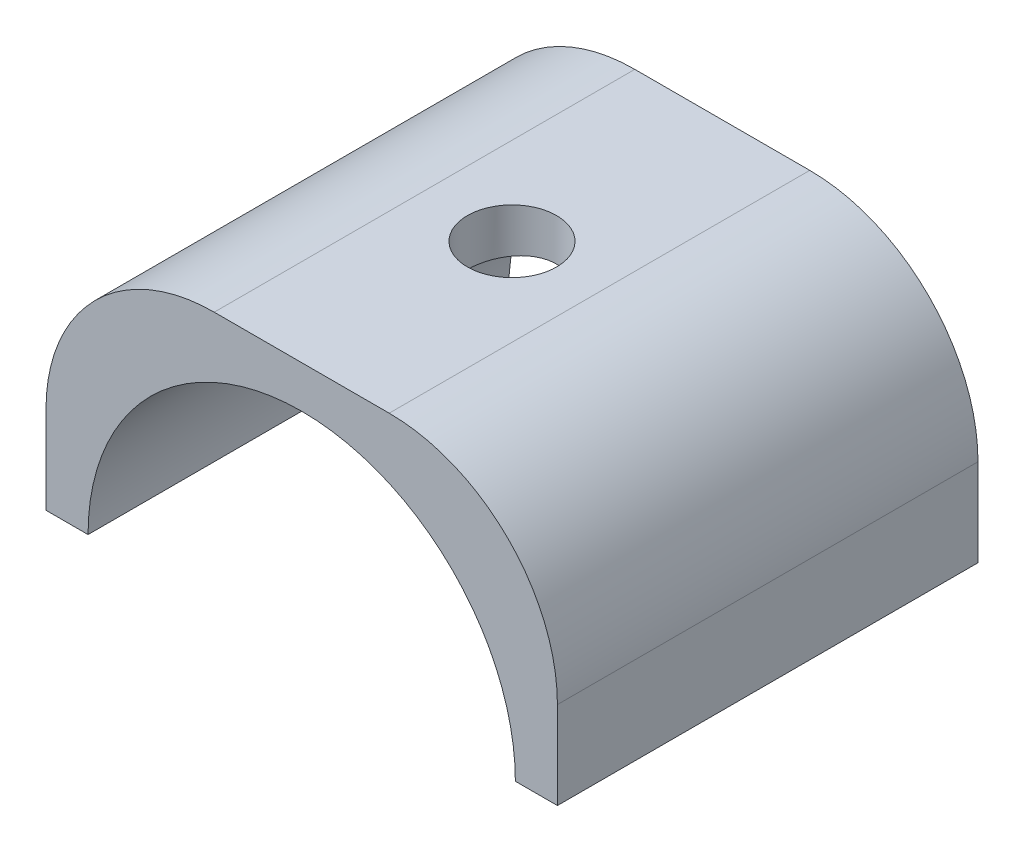
ISO-10303-21;
HEADER;
FILE_DESCRIPTION(('STEP AP214'),'2;1');
FILE_NAME('part.step','',(''),(''),'','','');
FILE_SCHEMA(('AUTOMOTIVE_DESIGN { 1 0 10303 214 1 1 1 1 }'));
ENDSEC;
DATA;
#1=APPLICATION_CONTEXT('core data for automotive mechanical design processes');
#2=APPLICATION_PROTOCOL_DEFINITION('international standard','automotive_design',2000,#1);
#3=PRODUCT_CONTEXT('',#1,'mechanical');
#4=PRODUCT('Part','Part','',(#3));
#5=PRODUCT_RELATED_PRODUCT_CATEGORY('part','',(#4));
#6=PRODUCT_DEFINITION_FORMATION('','',#4);
#7=PRODUCT_DEFINITION_CONTEXT('part definition',#1,'design');
#8=PRODUCT_DEFINITION('design','',#6,#7);
#9=PRODUCT_DEFINITION_SHAPE('','',#8);
#10=(LENGTH_UNIT() NAMED_UNIT(*) SI_UNIT(.MILLI.,.METRE.));
#11=(NAMED_UNIT(*) PLANE_ANGLE_UNIT() SI_UNIT($,.RADIAN.));
#12=(NAMED_UNIT(*) SI_UNIT($,.STERADIAN.) SOLID_ANGLE_UNIT());
#13=UNCERTAINTY_MEASURE_WITH_UNIT(LENGTH_MEASURE(1.E-05),#10,'distance_accuracy_value','');
#14=(GEOMETRIC_REPRESENTATION_CONTEXT(3) GLOBAL_UNCERTAINTY_ASSIGNED_CONTEXT((#13)) GLOBAL_UNIT_ASSIGNED_CONTEXT((#10,
#11,#12)) REPRESENTATION_CONTEXT('',''));
#15=CARTESIAN_POINT('',(0.,0.,0.));
#16=DIRECTION('',(0.,0.,1.));
#17=DIRECTION('',(1.,0.,0.));
#18=AXIS2_PLACEMENT_3D('',#15,#16,#17);
#19=CARTESIAN_POINT('',(5.2,5.2,12.5));
#20=DIRECTION('',(0.,0.,-1.));
#21=DIRECTION('',(-1.,0.,0.));
#22=AXIS2_PLACEMENT_3D('',#19,#20,#21);
#23=CYLINDRICAL_SURFACE('',#22,10.);
#24=CARTESIAN_POINT('',(5.2,5.2,-12.5));
#25=DIRECTION('',(0.,0.,1.));
#26=DIRECTION('',(1.,0.,0.));
#27=AXIS2_PLACEMENT_3D('',#24,#25,#26);
#28=CIRCLE('',#27,10.);
#29=CARTESIAN_POINT('',(15.2,5.2,-12.5));
#30=VERTEX_POINT('',#29);
#31=CARTESIAN_POINT('',(5.2,15.2,-12.5));
#32=VERTEX_POINT('',#31);
#33=EDGE_CURVE('E282',#30,#32,#28,.T.);
#34=ORIENTED_EDGE('',*,*,#33,.T.);
#35=DIRECTION('',(0.,0.,-1.));
#36=VECTOR('',#35,1.);
#37=CARTESIAN_POINT('',(5.2,15.2,12.5));
#38=LINE('',#37,#36);
#39=CARTESIAN_POINT('',(5.2,15.2,12.5));
#40=VERTEX_POINT('',#39);
#41=EDGE_CURVE('E11',#40,#32,#38,.T.);
#42=ORIENTED_EDGE('',*,*,#41,.F.);
#43=CARTESIAN_POINT('',(5.2,5.2,12.5));
#44=DIRECTION('',(0.,0.,1.));
#45=DIRECTION('',(1.,0.,0.));
#46=AXIS2_PLACEMENT_3D('',#43,#44,#45);
#47=CIRCLE('',#46,10.);
#48=CARTESIAN_POINT('',(15.2,5.2,12.5));
#49=VERTEX_POINT('',#48);
#50=EDGE_CURVE('E255',#49,#40,#47,.T.);
#51=ORIENTED_EDGE('',*,*,#50,.F.);
#52=DIRECTION('',(0.,0.,-1.));
#53=VECTOR('',#52,1.);
#54=CARTESIAN_POINT('',(15.2,5.2,12.5));
#55=LINE('',#54,#53);
#56=EDGE_CURVE('E281',#49,#30,#55,.T.);
#57=ORIENTED_EDGE('',*,*,#56,.T.);
#58=EDGE_LOOP('',(#34,#42,#51,#57));
#59=FACE_BOUND('',#58,.T.);
#60=ADVANCED_FACE('F39',(#59),#23,.T.);
#61=CARTESIAN_POINT('',(5.2,15.2,12.5));
#62=DIRECTION('',(0.,-1.,0.));
#63=DIRECTION('',(0.,0.,-1.));
#64=AXIS2_PLACEMENT_3D('',#61,#62,#63);
#65=PLANE('',#64);
#66=CARTESIAN_POINT('',(0.,15.2,0.));
#67=DIRECTION('',(0.,1.,0.));
#68=DIRECTION('',(0.,0.,1.));
#69=AXIS2_PLACEMENT_3D('',#66,#67,#68);
#70=CIRCLE('',#69,2.65);
#71=CARTESIAN_POINT('',(0.,15.2,2.65));
#72=VERTEX_POINT('',#71);
#73=EDGE_CURVE('E204',#72,#72,#70,.T.);
#74=ORIENTED_EDGE('',*,*,#73,.F.);
#75=EDGE_LOOP('',(#74));
#76=FACE_BOUND('',#75,.T.);
#77=DIRECTION('',(-1.,0.,0.));
#78=VECTOR('',#77,1.);
#79=CARTESIAN_POINT('',(5.2,15.2,-12.5));
#80=LINE('',#79,#78);
#81=CARTESIAN_POINT('',(-5.2,15.2,-12.5));
#82=VERTEX_POINT('',#81);
#83=EDGE_CURVE('E286',#32,#82,#80,.T.);
#84=ORIENTED_EDGE('',*,*,#83,.T.);
#85=DIRECTION('',(0.,0.,-1.));
#86=VECTOR('',#85,1.);
#87=CARTESIAN_POINT('',(-5.2,15.2,12.5));
#88=LINE('',#87,#86);
#89=CARTESIAN_POINT('',(-5.2,15.2,12.5));
#90=VERTEX_POINT('',#89);
#91=EDGE_CURVE('E53',#90,#82,#88,.T.);
#92=ORIENTED_EDGE('',*,*,#91,.F.);
#93=DIRECTION('',(-1.,0.,0.));
#94=VECTOR('',#93,1.);
#95=CARTESIAN_POINT('',(5.2,15.2,12.5));
#96=LINE('',#95,#94);
#97=EDGE_CURVE('E259',#40,#90,#96,.T.);
#98=ORIENTED_EDGE('',*,*,#97,.F.);
#99=ORIENTED_EDGE('',*,*,#41,.T.);
#100=EDGE_LOOP('',(#84,#92,#98,#99));
#101=FACE_BOUND('',#100,.T.);
#102=ADVANCED_FACE('F359',(#76,#101),#65,.F.);
#103=CARTESIAN_POINT('',(-5.2,5.2,12.5));
#104=DIRECTION('',(0.,0.,-1.));
#105=DIRECTION('',(-1.,0.,0.));
#106=AXIS2_PLACEMENT_3D('',#103,#104,#105);
#107=CYLINDRICAL_SURFACE('',#106,10.);
#108=CARTESIAN_POINT('',(-5.2,5.2,-12.5));
#109=DIRECTION('',(0.,0.,1.));
#110=DIRECTION('',(1.,0.,0.));
#111=AXIS2_PLACEMENT_3D('',#108,#109,#110);
#112=CIRCLE('',#111,10.);
#113=CARTESIAN_POINT('',(-15.2,5.2,-12.5));
#114=VERTEX_POINT('',#113);
#115=EDGE_CURVE('E289',#82,#114,#112,.T.);
#116=ORIENTED_EDGE('',*,*,#115,.T.);
#117=DIRECTION('',(0.,0.,-1.));
#118=VECTOR('',#117,1.);
#119=CARTESIAN_POINT('',(-15.2,5.2,12.5));
#120=LINE('',#119,#118);
#121=CARTESIAN_POINT('',(-15.2,5.2,12.5));
#122=VERTEX_POINT('',#121);
#123=EDGE_CURVE('E325',#122,#114,#120,.T.);
#124=ORIENTED_EDGE('',*,*,#123,.F.);
#125=CARTESIAN_POINT('',(-5.2,5.2,12.5));
#126=DIRECTION('',(0.,0.,1.));
#127=DIRECTION('',(1.,0.,0.));
#128=AXIS2_PLACEMENT_3D('',#125,#126,#127);
#129=CIRCLE('',#128,10.);
#130=EDGE_CURVE('E263',#90,#122,#129,.T.);
#131=ORIENTED_EDGE('',*,*,#130,.F.);
#132=ORIENTED_EDGE('',*,*,#91,.T.);
#133=EDGE_LOOP('',(#116,#124,#131,#132));
#134=FACE_BOUND('',#133,.T.);
#135=ADVANCED_FACE('F336',(#134),#107,.T.);
#136=CARTESIAN_POINT('',(-15.2,0.,12.5));
#137=DIRECTION('',(1.,0.,0.));
#138=DIRECTION('',(0.,0.,-1.));
#139=AXIS2_PLACEMENT_3D('',#136,#137,#138);
#140=PLANE('',#139);
#141=DIRECTION('',(0.,-1.,0.));
#142=VECTOR('',#141,1.);
#143=CARTESIAN_POINT('',(-15.2,0.,-12.5));
#144=LINE('',#143,#142);
#145=CARTESIAN_POINT('',(-15.2,0.,-12.5));
#146=VERTEX_POINT('',#145);
#147=EDGE_CURVE('E292',#114,#146,#144,.T.);
#148=ORIENTED_EDGE('',*,*,#147,.T.);
#149=DIRECTION('',(0.,0.,-1.));
#150=VECTOR('',#149,1.);
#151=CARTESIAN_POINT('',(-15.2,0.,12.5));
#152=LINE('',#151,#150);
#153=CARTESIAN_POINT('',(-15.2,0.,12.5));
#154=VERTEX_POINT('',#153);
#155=EDGE_CURVE('E321',#154,#146,#152,.T.);
#156=ORIENTED_EDGE('',*,*,#155,.F.);
#157=DIRECTION('',(0.,-1.,0.));
#158=VECTOR('',#157,1.);
#159=CARTESIAN_POINT('',(-15.2,0.,12.5));
#160=LINE('',#159,#158);
#161=EDGE_CURVE('E266',#122,#154,#160,.T.);
#162=ORIENTED_EDGE('',*,*,#161,.F.);
#163=ORIENTED_EDGE('',*,*,#123,.T.);
#164=EDGE_LOOP('',(#148,#156,#162,#163));
#165=FACE_BOUND('',#164,.T.);
#166=ADVANCED_FACE('F347',(#165),#140,.F.);
#167=CARTESIAN_POINT('',(-15.2,0.,12.5));
#168=DIRECTION('',(0.,1.,0.));
#169=DIRECTION('',(-1.,0.,0.));
#170=AXIS2_PLACEMENT_3D('',#167,#168,#169);
#171=PLANE('',#170);
#172=DIRECTION('',(-1.,0.,0.));
#173=VECTOR('',#172,1.);
#174=CARTESIAN_POINT('',(-14.45,0.,10.));
#175=LINE('',#174,#173);
#176=CARTESIAN_POINT('',(-13.45,0.,10.));
#177=VERTEX_POINT('',#176);
#178=CARTESIAN_POINT('',(-14.45,0.,10.));
#179=VERTEX_POINT('',#178);
#180=EDGE_CURVE('E195',#177,#179,#175,.T.);
#181=ORIENTED_EDGE('',*,*,#180,.F.);
#182=DIRECTION('',(0.,0.,1.));
#183=VECTOR('',#182,1.);
#184=CARTESIAN_POINT('',(-13.45,0.,-10.));
#185=LINE('',#184,#183);
#186=CARTESIAN_POINT('',(-13.45,0.,-10.));
#187=VERTEX_POINT('',#186);
#188=EDGE_CURVE('E60',#187,#177,#185,.T.);
#189=ORIENTED_EDGE('',*,*,#188,.F.);
#190=DIRECTION('',(1.,0.,0.));
#191=VECTOR('',#190,1.);
#192=CARTESIAN_POINT('',(-14.45,0.,-10.));
#193=LINE('',#192,#191);
#194=CARTESIAN_POINT('',(-14.45,0.,-10.));
#195=VERTEX_POINT('',#194);
#196=EDGE_CURVE('E181',#195,#187,#193,.T.);
#197=ORIENTED_EDGE('',*,*,#196,.F.);
#198=DIRECTION('',(0.,0.,-1.));
#199=VECTOR('',#198,1.);
#200=CARTESIAN_POINT('',(-14.45,0.,-10.));
#201=LINE('',#200,#199);
#202=EDGE_CURVE('E186',#179,#195,#201,.T.);
#203=ORIENTED_EDGE('',*,*,#202,.F.);
#204=EDGE_LOOP('',(#181,#189,#197,#203));
#205=FACE_BOUND('',#204,.T.);
#206=DIRECTION('',(1.,0.,0.));
#207=VECTOR('',#206,1.);
#208=CARTESIAN_POINT('',(-15.2,0.,-12.5));
#209=LINE('',#208,#207);
#210=CARTESIAN_POINT('',(-12.7,0.,-12.5));
#211=VERTEX_POINT('',#210);
#212=EDGE_CURVE('E295',#146,#211,#209,.T.);
#213=ORIENTED_EDGE('',*,*,#212,.T.);
#214=DIRECTION('',(0.,0.,-1.));
#215=VECTOR('',#214,1.);
#216=CARTESIAN_POINT('',(-12.7,0.,12.5));
#217=LINE('',#216,#215);
#218=CARTESIAN_POINT('',(-12.7,0.,12.5));
#219=VERTEX_POINT('',#218);
#220=EDGE_CURVE('E317',#219,#211,#217,.T.);
#221=ORIENTED_EDGE('',*,*,#220,.F.);
#222=DIRECTION('',(1.,0.,0.));
#223=VECTOR('',#222,1.);
#224=CARTESIAN_POINT('',(-15.2,0.,12.5));
#225=LINE('',#224,#223);
#226=EDGE_CURVE('E269',#154,#219,#225,.T.);
#227=ORIENTED_EDGE('',*,*,#226,.F.);
#228=ORIENTED_EDGE('',*,*,#155,.T.);
#229=EDGE_LOOP('',(#213,#221,#227,#228));
#230=FACE_BOUND('',#229,.T.);
#231=ADVANCED_FACE('F351',(#205,#230),#171,.F.);
#232=CARTESIAN_POINT('',(0.,0.,12.5));
#233=DIRECTION('',(0.,0.,-1.));
#234=DIRECTION('',(-1.,0.,0.));
#235=AXIS2_PLACEMENT_3D('',#232,#233,#234);
#236=CYLINDRICAL_SURFACE('',#235,12.7);
#237=CARTESIAN_POINT('',(0.,12.7,2.65));
#238=CARTESIAN_POINT('',(0.147141882897111,12.6999972763347,2.64999475465868));
#239=CARTESIAN_POINT('',(0.294348726054904,12.6974166980673,2.63770347265537));
#240=CARTESIAN_POINT('',(0.584592235158729,12.6873713227314,2.58890755430151));
#241=CARTESIAN_POINT('',(0.727625652744173,12.6799028218124,2.55238455594515));
#242=CARTESIAN_POINT('',(1.00528473690564,12.6609144811852,2.45631004538645));
#243=CARTESIAN_POINT('',(1.13991863313509,12.6493986827301,2.39678149849168));
#244=CARTESIAN_POINT('',(1.39728064695569,12.6235635459398,2.25645606395814));
#245=CARTESIAN_POINT('',(1.52000929057391,12.6092443315563,2.17566011659413));
#246=CARTESIAN_POINT('',(1.75188561540099,12.5791400264574,1.99383714269698));
#247=CARTESIAN_POINT('',(1.86083344538849,12.5633381330538,1.89255800687734));
#248=CARTESIAN_POINT('',(2.06032392646105,12.5321699287456,1.67318523480255));
#249=CARTESIAN_POINT('',(2.15086505077388,12.516803654065,1.55509020510783));
#250=CARTESIAN_POINT('',(2.31183670942836,12.4880817512634,1.30398221472771));
#251=CARTESIAN_POINT('',(2.38205767324146,12.4747477039077,1.17083222199957));
#252=CARTESIAN_POINT('',(2.49905234910732,12.4518398078046,0.894298512625698));
#253=CARTESIAN_POINT('',(2.54582859579428,12.4422655526061,0.750915904154835));
#254=CARTESIAN_POINT('',(2.61395192718573,12.4281318076225,0.460145423463227));
#255=CARTESIAN_POINT('',(2.63565112007276,12.4235029509428,0.312843487202827));
#256=CARTESIAN_POINT('',(2.6540985924028,12.4195755229538,0.0166227181360824));
#257=CARTESIAN_POINT('',(2.65084965464925,12.4202763571517,-0.132295932485803));
#258=CARTESIAN_POINT('',(2.61977717314308,12.4268662012071,-0.424928131939138));
#259=CARTESIAN_POINT('',(2.59235969216865,12.4326694792853,-0.56868701825834));
#260=CARTESIAN_POINT('',(2.51437043169713,12.4486750880903,-0.849518694026506));
#261=CARTESIAN_POINT('',(2.46379745860189,12.4588776455855,-0.986591138405782));
#262=CARTESIAN_POINT('',(2.34055182042824,12.4826184585991,-1.25131618063678));
#263=CARTESIAN_POINT('',(2.26772038872651,12.4961805409951,-1.37889263741752));
#264=CARTESIAN_POINT('',(2.10213709349326,12.5250973158712,-1.62016481226238));
#265=CARTESIAN_POINT('',(2.00938274713902,12.5404522316679,-1.73385879750025));
#266=CARTESIAN_POINT('',(1.80442358397749,12.5715943668517,-1.94647941827634));
#267=CARTESIAN_POINT('',(1.69187276734042,12.5873841563106,-2.04507244689971));
#268=CARTESIAN_POINT('',(1.45165961406066,12.6173416738254,-2.22203478951815));
#269=CARTESIAN_POINT('',(1.32399704933812,12.631509377393,-2.30040379821769));
#270=CARTESIAN_POINT('',(1.05679717182286,12.6566660975857,-2.43476451292158));
#271=CARTESIAN_POINT('',(0.917238837604389,12.6676493295507,-2.49071556575015));
#272=CARTESIAN_POINT('',(0.630422255980448,12.6851561394605,-2.57828286996085));
#273=CARTESIAN_POINT('',(0.483165028279239,12.6916803063975,-2.60990233534086));
#274=CARTESIAN_POINT('',(0.187995182270744,12.6994510445978,-2.64743076462122));
#275=CARTESIAN_POINT('',(0.0401429528166278,12.7007912412963,-2.65379589111137));
#276=CARTESIAN_POINT('',(-0.254512218231061,12.69830413272,-2.64186703418381));
#277=CARTESIAN_POINT('',(-0.401315223729108,12.6944771449031,-2.62357456566271));
#278=CARTESIAN_POINT('',(-0.688215139982566,12.6821444836504,-2.56322845841393));
#279=CARTESIAN_POINT('',(-0.828363955680935,12.6736853827337,-2.52141123138305));
#280=CARTESIAN_POINT('',(-1.09965953956823,12.6530342115635,-2.4154628203329));
#281=CARTESIAN_POINT('',(-1.23080558908868,12.6408418437157,-2.35132985737808));
#282=CARTESIAN_POINT('',(-1.48227976768071,12.6138442773516,-2.20160013701121));
#283=CARTESIAN_POINT('',(-1.60244262191945,12.5990067736679,-2.11573174807266));
#284=CARTESIAN_POINT('',(-1.82681720599617,12.5684360253891,-1.92532962658825));
#285=CARTESIAN_POINT('',(-1.93102706032944,12.5527026757724,-1.82079370253006));
#286=CARTESIAN_POINT('',(-2.12231758796238,12.5217943375682,-1.59393952979798));
#287=CARTESIAN_POINT('',(-2.20908383725437,12.5066330248723,-1.47135395341373));
#288=CARTESIAN_POINT('',(-2.36079659493772,12.4788866385666,-1.21308133836605));
#289=CARTESIAN_POINT('',(-2.42574401307147,12.4663014575528,-1.07739484625283));
#290=CARTESIAN_POINT('',(-2.53155850799125,12.4452450938604,-0.797479129438785));
#291=CARTESIAN_POINT('',(-2.57255575495104,12.4367517171345,-0.653300862441296));
#292=CARTESIAN_POINT('',(-2.62969528570611,12.4247965890246,-0.359904009243205));
#293=CARTESIAN_POINT('',(-2.64584113772638,12.421334115295,-0.210686149784604));
#294=CARTESIAN_POINT('',(-2.65267845237252,12.4198754027452,0.0853914221250781));
#295=CARTESIAN_POINT('',(-2.64386748437957,12.4217723108855,0.232239340496511));
#296=CARTESIAN_POINT('',(-2.60214584032668,12.4305785689402,0.522309661906972));
#297=CARTESIAN_POINT('',(-2.5692353971491,12.4374878704179,0.665532099966552));
#298=CARTESIAN_POINT('',(-2.4804794357266,12.4554906623169,0.943933730370845));
#299=CARTESIAN_POINT('',(-2.42470009862847,12.4665720714225,1.07913485410109));
#300=CARTESIAN_POINT('',(-2.29184902946698,12.4916763515531,1.33833579168494));
#301=CARTESIAN_POINT('',(-2.2147753131608,12.5056994966643,1.46233456025642));
#302=CARTESIAN_POINT('',(-2.03984608298033,12.535430641616,1.6980774321895));
#303=CARTESIAN_POINT('',(-1.94163334740716,12.5511649557007,1.80955319594281));
#304=CARTESIAN_POINT('',(-1.72794550486875,12.5823622745988,2.01460567207086));
#305=CARTESIAN_POINT('',(-1.6124664286996,12.5978252161132,2.10817825754015));
#306=CARTESIAN_POINT('',(-1.36591513995684,12.6269492110412,2.27579781796373));
#307=CARTESIAN_POINT('',(-1.2346778969598,12.640587333888,2.34960622720327));
#308=CARTESIAN_POINT('',(-0.96140967034859,12.6642975607395,2.47400232368923));
#309=CARTESIAN_POINT('',(-0.819388238964411,12.6743727768916,2.52461028769961));
#310=CARTESIAN_POINT('',(-0.564271087485326,12.6879363706482,2.59171884962817));
#311=CARTESIAN_POINT('',(-0.45259637894257,12.6924330652456,2.61353409688428));
#312=CARTESIAN_POINT('',(-0.227293986753254,12.6984658769144,2.64267642883828));
#313=CARTESIAN_POINT('',(-0.113666375848895,12.700002104018,2.65000405200018));
#314=CARTESIAN_POINT('',(0.,12.7,2.65));
#315=B_SPLINE_CURVE_WITH_KNOTS('',3,(#237,#238,#239,#240,#241,#242,#243,#244,#245,#246,#247,
#248,#249,#250,#251,#252,#253,#254,#255,#256,#257,#258,#259,#260,#261,#262,#263,#264,#265,#266,
#267,#268,#269,#270,#271,#272,#273,#274,#275,#276,#277,#278,#279,#280,#281,#282,#283,#284,#285,
#286,#287,#288,#289,#290,#291,#292,#293,#294,#295,#296,#297,#298,#299,#300,#301,#302,#303,#304,
#305,#306,#307,#308,#309,#310,#311,#312,#313,#314),.UNSPECIFIED.,.T.,.F.,(4,2,2,2,2,2,2,2,2,2,2,
2,2,2,2,2,2,2,2,2,2,2,2,2,2,2,2,2,2,2,2,2,2,2,2,2,2,2,4),(0.,0.441009716560806,
0.882353998194363,1.32325884083949,1.76414419346331,2.21082821198089,2.6575492662813,
3.10872551711874,3.55985298026752,4.00456608388388,4.44922958333559,4.88656158924155,
5.32391614087658,5.76446612237943,6.20507103775138,6.65432304235844,7.10358182833794,
7.55365166156387,8.00366203414392,8.44550594318443,8.88732270775553,9.32477678197637,
9.76226573655943,10.2055181274491,10.6488225890832,11.0995152534722,11.550189123769,
11.9983902097276,12.4465269358564,12.8857923193398,13.3250534580914,13.7630522761117,
14.2010919213046,14.6472142189438,15.0934392297548,15.5448297035978,15.9958249147861,
16.3365153995618,16.6771932215975),.UNSPECIFIED.);
#316=CARTESIAN_POINT('',(0.,12.7,2.65));
#317=VERTEX_POINT('',#316);
#318=EDGE_CURVE('E42',#317,#317,#315,.T.);
#319=ORIENTED_EDGE('',*,*,#318,.T.);
#320=EDGE_LOOP('',(#319));
#321=FACE_BOUND('',#320,.T.);
#322=CARTESIAN_POINT('',(0.,0.,-12.5));
#323=DIRECTION('',(0.,0.,-1.));
#324=DIRECTION('',(1.,0.,0.));
#325=AXIS2_PLACEMENT_3D('',#322,#323,#324);
#326=CIRCLE('',#325,12.7);
#327=CARTESIAN_POINT('',(12.7,0.,-12.5));
#328=VERTEX_POINT('',#327);
#329=EDGE_CURVE('E298',#211,#328,#326,.T.);
#330=ORIENTED_EDGE('',*,*,#329,.T.);
#331=DIRECTION('',(0.,0.,-1.));
#332=VECTOR('',#331,1.);
#333=CARTESIAN_POINT('',(12.7,0.,12.5));
#334=LINE('',#333,#332);
#335=CARTESIAN_POINT('',(12.7,0.,12.5));
#336=VERTEX_POINT('',#335);
#337=EDGE_CURVE('E313',#336,#328,#334,.T.);
#338=ORIENTED_EDGE('',*,*,#337,.F.);
#339=CARTESIAN_POINT('',(0.,0.,12.5));
#340=DIRECTION('',(0.,0.,-1.));
#341=DIRECTION('',(1.,0.,0.));
#342=AXIS2_PLACEMENT_3D('',#339,#340,#341);
#343=CIRCLE('',#342,12.7);
#344=EDGE_CURVE('E272',#219,#336,#343,.T.);
#345=ORIENTED_EDGE('',*,*,#344,.F.);
#346=ORIENTED_EDGE('',*,*,#220,.T.);
#347=EDGE_LOOP('',(#330,#338,#345,#346));
#348=FACE_BOUND('',#347,.T.);
#349=ADVANCED_FACE('F372',(#321,#348),#236,.F.);
#350=CARTESIAN_POINT('',(12.7,0.,12.5));
#351=DIRECTION('',(0.,1.,0.));
#352=DIRECTION('',(-1.,0.,0.));
#353=AXIS2_PLACEMENT_3D('',#350,#351,#352);
#354=PLANE('',#353);
#355=DIRECTION('',(-1.,0.,0.));
#356=VECTOR('',#355,1.);
#357=CARTESIAN_POINT('',(14.45,0.,10.));
#358=LINE('',#357,#356);
#359=CARTESIAN_POINT('',(14.45,0.,10.));
#360=VERTEX_POINT('',#359);
#361=CARTESIAN_POINT('',(13.45,0.,10.));
#362=VERTEX_POINT('',#361);
#363=EDGE_CURVE('E232',#360,#362,#358,.T.);
#364=ORIENTED_EDGE('',*,*,#363,.F.);
#365=DIRECTION('',(0.,0.,1.));
#366=VECTOR('',#365,1.);
#367=CARTESIAN_POINT('',(14.45,0.,-10.));
#368=LINE('',#367,#366);
#369=CARTESIAN_POINT('',(14.45,0.,-10.));
#370=VERTEX_POINT('',#369);
#371=EDGE_CURVE('E68',#370,#360,#368,.T.);
#372=ORIENTED_EDGE('',*,*,#371,.F.);
#373=DIRECTION('',(1.,0.,0.));
#374=VECTOR('',#373,1.);
#375=CARTESIAN_POINT('',(14.45,0.,-10.));
#376=LINE('',#375,#374);
#377=CARTESIAN_POINT('',(13.45,0.,-10.));
#378=VERTEX_POINT('',#377);
#379=EDGE_CURVE('E223',#378,#370,#376,.T.);
#380=ORIENTED_EDGE('',*,*,#379,.F.);
#381=DIRECTION('',(0.,0.,-1.));
#382=VECTOR('',#381,1.);
#383=CARTESIAN_POINT('',(13.45,0.,-10.));
#384=LINE('',#383,#382);
#385=EDGE_CURVE('E227',#362,#378,#384,.T.);
#386=ORIENTED_EDGE('',*,*,#385,.F.);
#387=EDGE_LOOP('',(#364,#372,#380,#386));
#388=FACE_BOUND('',#387,.T.);
#389=DIRECTION('',(1.,0.,0.));
#390=VECTOR('',#389,1.);
#391=CARTESIAN_POINT('',(12.7,0.,-12.5));
#392=LINE('',#391,#390);
#393=CARTESIAN_POINT('',(15.2,0.,-12.5));
#394=VERTEX_POINT('',#393);
#395=EDGE_CURVE('E301',#328,#394,#392,.T.);
#396=ORIENTED_EDGE('',*,*,#395,.T.);
#397=DIRECTION('',(0.,0.,-1.));
#398=VECTOR('',#397,1.);
#399=CARTESIAN_POINT('',(15.2,0.,12.5));
#400=LINE('',#399,#398);
#401=CARTESIAN_POINT('',(15.2,0.,12.5));
#402=VERTEX_POINT('',#401);
#403=EDGE_CURVE('E309',#402,#394,#400,.T.);
#404=ORIENTED_EDGE('',*,*,#403,.F.);
#405=DIRECTION('',(1.,0.,0.));
#406=VECTOR('',#405,1.);
#407=CARTESIAN_POINT('',(12.7,0.,12.5));
#408=LINE('',#407,#406);
#409=EDGE_CURVE('E275',#336,#402,#408,.T.);
#410=ORIENTED_EDGE('',*,*,#409,.F.);
#411=ORIENTED_EDGE('',*,*,#337,.T.);
#412=EDGE_LOOP('',(#396,#404,#410,#411));
#413=FACE_BOUND('',#412,.T.);
#414=ADVANCED_FACE('F370',(#388,#413),#354,.F.);
#415=CARTESIAN_POINT('',(15.2,0.,12.5));
#416=DIRECTION('',(-1.,0.,0.));
#417=DIRECTION('',(0.,0.,1.));
#418=AXIS2_PLACEMENT_3D('',#415,#416,#417);
#419=PLANE('',#418);
#420=DIRECTION('',(0.,1.,0.));
#421=VECTOR('',#420,1.);
#422=CARTESIAN_POINT('',(15.2,0.,-12.5));
#423=LINE('',#422,#421);
#424=EDGE_CURVE('E260',#394,#30,#423,.T.);
#425=ORIENTED_EDGE('',*,*,#424,.T.);
#426=ORIENTED_EDGE('',*,*,#56,.F.);
#427=DIRECTION('',(0.,1.,0.));
#428=VECTOR('',#427,1.);
#429=CARTESIAN_POINT('',(15.2,0.,12.5));
#430=LINE('',#429,#428);
#431=EDGE_CURVE('E278',#402,#49,#430,.T.);
#432=ORIENTED_EDGE('',*,*,#431,.F.);
#433=ORIENTED_EDGE('',*,*,#403,.T.);
#434=EDGE_LOOP('',(#425,#426,#432,#433));
#435=FACE_BOUND('',#434,.T.);
#436=ADVANCED_FACE('F365',(#435),#419,.F.);
#437=CARTESIAN_POINT('',(5.2,5.2,12.5));
#438=DIRECTION('',(0.,0.,1.));
#439=DIRECTION('',(1.,0.,0.));
#440=AXIS2_PLACEMENT_3D('',#437,#438,#439);
#441=PLANE('',#440);
#442=ORIENTED_EDGE('',*,*,#50,.T.);
#443=ORIENTED_EDGE('',*,*,#97,.T.);
#444=ORIENTED_EDGE('',*,*,#130,.T.);
#445=ORIENTED_EDGE('',*,*,#161,.T.);
#446=ORIENTED_EDGE('',*,*,#226,.T.);
#447=ORIENTED_EDGE('',*,*,#344,.T.);
#448=ORIENTED_EDGE('',*,*,#409,.T.);
#449=ORIENTED_EDGE('',*,*,#431,.T.);
#450=EDGE_LOOP('',(#442,#443,#444,#445,#446,#447,#448,#449));
#451=FACE_BOUND('',#450,.T.);
#452=ADVANCED_FACE('F355',(#451),#441,.T.);
#453=CARTESIAN_POINT('',(5.2,5.2,-12.5));
#454=DIRECTION('',(0.,0.,1.));
#455=DIRECTION('',(1.,0.,0.));
#456=AXIS2_PLACEMENT_3D('',#453,#454,#455);
#457=PLANE('',#456);
#458=ORIENTED_EDGE('',*,*,#33,.F.);
#459=ORIENTED_EDGE('',*,*,#424,.F.);
#460=ORIENTED_EDGE('',*,*,#395,.F.);
#461=ORIENTED_EDGE('',*,*,#329,.F.);
#462=ORIENTED_EDGE('',*,*,#212,.F.);
#463=ORIENTED_EDGE('',*,*,#147,.F.);
#464=ORIENTED_EDGE('',*,*,#115,.F.);
#465=ORIENTED_EDGE('',*,*,#83,.F.);
#466=EDGE_LOOP('',(#458,#459,#460,#461,#462,#463,#464,#465));
#467=FACE_BOUND('',#466,.T.);
#468=ADVANCED_FACE('F342',(#467),#457,.F.);
#469=CARTESIAN_POINT('',(0.,15.2,0.));
#470=DIRECTION('',(0.,1.,0.));
#471=DIRECTION('',(0.,0.,1.));
#472=AXIS2_PLACEMENT_3D('',#469,#470,#471);
#473=CYLINDRICAL_SURFACE('',#472,2.65);
#474=ORIENTED_EDGE('',*,*,#73,.T.);
#475=EDGE_LOOP('',(#474));
#476=FACE_BOUND('',#475,.T.);
#477=ORIENTED_EDGE('',*,*,#318,.F.);
#478=EDGE_LOOP('',(#477));
#479=FACE_BOUND('',#478,.T.);
#480=ADVANCED_FACE('F414',(#476,#479),#473,.F.);
#481=CARTESIAN_POINT('',(14.45,3.,-10.));
#482=DIRECTION('',(1.,0.,0.));
#483=DIRECTION('',(0.,0.,-1.));
#484=AXIS2_PLACEMENT_3D('',#481,#482,#483);
#485=PLANE('',#484);
#486=ORIENTED_EDGE('',*,*,#371,.T.);
#487=DIRECTION('',(0.,-1.,0.));
#488=VECTOR('',#487,1.);
#489=CARTESIAN_POINT('',(14.45,3.,10.));
#490=LINE('',#489,#488);
#491=CARTESIAN_POINT('',(14.45,3.,10.));
#492=VERTEX_POINT('',#491);
#493=EDGE_CURVE('E210',#492,#360,#490,.T.);
#494=ORIENTED_EDGE('',*,*,#493,.F.);
#495=DIRECTION('',(0.,0.,1.));
#496=VECTOR('',#495,1.);
#497=CARTESIAN_POINT('',(14.45,3.,-10.));
#498=LINE('',#497,#496);
#499=CARTESIAN_POINT('',(14.45,3.,-10.));
#500=VERTEX_POINT('',#499);
#501=EDGE_CURVE('E228',#500,#492,#498,.T.);
#502=ORIENTED_EDGE('',*,*,#501,.F.);
#503=DIRECTION('',(0.,-1.,0.));
#504=VECTOR('',#503,1.);
#505=CARTESIAN_POINT('',(14.45,3.,-10.));
#506=LINE('',#505,#504);
#507=EDGE_CURVE('E220',#500,#370,#506,.T.);
#508=ORIENTED_EDGE('',*,*,#507,.T.);
#509=EDGE_LOOP('',(#486,#494,#502,#508));
#510=FACE_BOUND('',#509,.T.);
#511=ADVANCED_FACE('F427',(#510),#485,.F.);
#512=CARTESIAN_POINT('',(14.45,3.,-10.));
#513=DIRECTION('',(0.,0.,-1.));
#514=DIRECTION('',(-1.,0.,0.));
#515=AXIS2_PLACEMENT_3D('',#512,#513,#514);
#516=PLANE('',#515);
#517=ORIENTED_EDGE('',*,*,#379,.T.);
#518=ORIENTED_EDGE('',*,*,#507,.F.);
#519=DIRECTION('',(1.,0.,0.));
#520=VECTOR('',#519,1.);
#521=CARTESIAN_POINT('',(14.45,3.,-10.));
#522=LINE('',#521,#520);
#523=CARTESIAN_POINT('',(13.45,3.,-10.));
#524=VERTEX_POINT('',#523);
#525=EDGE_CURVE('E213',#524,#500,#522,.T.);
#526=ORIENTED_EDGE('',*,*,#525,.F.);
#527=DIRECTION('',(0.,-1.,0.));
#528=VECTOR('',#527,1.);
#529=CARTESIAN_POINT('',(13.45,3.,-10.));
#530=LINE('',#529,#528);
#531=EDGE_CURVE('E217',#524,#378,#530,.T.);
#532=ORIENTED_EDGE('',*,*,#531,.T.);
#533=EDGE_LOOP('',(#517,#518,#526,#532));
#534=FACE_BOUND('',#533,.T.);
#535=ADVANCED_FACE('F432',(#534),#516,.F.);
#536=CARTESIAN_POINT('',(13.45,3.,-10.));
#537=DIRECTION('',(-1.,0.,0.));
#538=DIRECTION('',(0.,0.,1.));
#539=AXIS2_PLACEMENT_3D('',#536,#537,#538);
#540=PLANE('',#539);
#541=ORIENTED_EDGE('',*,*,#385,.T.);
#542=ORIENTED_EDGE('',*,*,#531,.F.);
#543=DIRECTION('',(0.,0.,-1.));
#544=VECTOR('',#543,1.);
#545=CARTESIAN_POINT('',(13.45,3.,-10.));
#546=LINE('',#545,#544);
#547=CARTESIAN_POINT('',(13.45,3.,10.));
#548=VERTEX_POINT('',#547);
#549=EDGE_CURVE('E241',#548,#524,#546,.T.);
#550=ORIENTED_EDGE('',*,*,#549,.F.);
#551=DIRECTION('',(0.,-1.,0.));
#552=VECTOR('',#551,1.);
#553=CARTESIAN_POINT('',(13.45,3.,10.));
#554=LINE('',#553,#552);
#555=EDGE_CURVE('E214',#548,#362,#554,.T.);
#556=ORIENTED_EDGE('',*,*,#555,.T.);
#557=EDGE_LOOP('',(#541,#542,#550,#556));
#558=FACE_BOUND('',#557,.T.);
#559=ADVANCED_FACE('F442',(#558),#540,.F.);
#560=CARTESIAN_POINT('',(14.45,3.,10.));
#561=DIRECTION('',(0.,0.,1.));
#562=DIRECTION('',(1.,0.,0.));
#563=AXIS2_PLACEMENT_3D('',#560,#561,#562);
#564=PLANE('',#563);
#565=ORIENTED_EDGE('',*,*,#363,.T.);
#566=ORIENTED_EDGE('',*,*,#555,.F.);
#567=DIRECTION('',(-1.,0.,0.));
#568=VECTOR('',#567,1.);
#569=CARTESIAN_POINT('',(14.45,3.,10.));
#570=LINE('',#569,#568);
#571=EDGE_CURVE('E245',#492,#548,#570,.T.);
#572=ORIENTED_EDGE('',*,*,#571,.F.);
#573=ORIENTED_EDGE('',*,*,#493,.T.);
#574=EDGE_LOOP('',(#565,#566,#572,#573));
#575=FACE_BOUND('',#574,.T.);
#576=ADVANCED_FACE('F453',(#575),#564,.F.);
#577=CARTESIAN_POINT('',(0.,3.,0.));
#578=DIRECTION('',(0.,-1.,0.));
#579=DIRECTION('',(1.,0.,0.));
#580=AXIS2_PLACEMENT_3D('',#577,#578,#579);
#581=PLANE('',#580);
#582=ORIENTED_EDGE('',*,*,#501,.T.);
#583=ORIENTED_EDGE('',*,*,#571,.T.);
#584=ORIENTED_EDGE('',*,*,#549,.T.);
#585=ORIENTED_EDGE('',*,*,#525,.T.);
#586=EDGE_LOOP('',(#582,#583,#584,#585));
#587=FACE_BOUND('',#586,.T.);
#588=ADVANCED_FACE('F464',(#587),#581,.T.);
#589=CARTESIAN_POINT('',(-13.45,3.,-10.));
#590=DIRECTION('',(1.,0.,0.));
#591=DIRECTION('',(0.,1.,0.));
#592=AXIS2_PLACEMENT_3D('',#589,#590,#591);
#593=PLANE('',#592);
#594=ORIENTED_EDGE('',*,*,#188,.T.);
#595=DIRECTION('',(0.,-1.,0.));
#596=VECTOR('',#595,1.);
#597=CARTESIAN_POINT('',(-13.45,3.,10.));
#598=LINE('',#597,#596);
#599=CARTESIAN_POINT('',(-13.45,3.,10.));
#600=VERTEX_POINT('',#599);
#601=EDGE_CURVE('E156',#600,#177,#598,.T.);
#602=ORIENTED_EDGE('',*,*,#601,.F.);
#603=DIRECTION('',(0.,0.,1.));
#604=VECTOR('',#603,1.);
#605=CARTESIAN_POINT('',(-13.45,3.,-10.));
#606=LINE('',#605,#604);
#607=CARTESIAN_POINT('',(-13.45,3.,-10.));
#608=VERTEX_POINT('',#607);
#609=EDGE_CURVE('E160',#608,#600,#606,.T.);
#610=ORIENTED_EDGE('',*,*,#609,.F.);
#611=DIRECTION('',(0.,-1.,0.));
#612=VECTOR('',#611,1.);
#613=CARTESIAN_POINT('',(-13.45,3.,-10.));
#614=LINE('',#613,#612);
#615=EDGE_CURVE('E201',#608,#187,#614,.T.);
#616=ORIENTED_EDGE('',*,*,#615,.T.);
#617=EDGE_LOOP('',(#594,#602,#610,#616));
#618=FACE_BOUND('',#617,.T.);
#619=ADVANCED_FACE('F158',(#618),#593,.F.);
#620=CARTESIAN_POINT('',(-14.45,3.,-10.));
#621=DIRECTION('',(0.,0.,-1.));
#622=DIRECTION('',(-1.,0.,0.));
#623=AXIS2_PLACEMENT_3D('',#620,#621,#622);
#624=PLANE('',#623);
#625=ORIENTED_EDGE('',*,*,#196,.T.);
#626=ORIENTED_EDGE('',*,*,#615,.F.);
#627=DIRECTION('',(1.,0.,0.));
#628=VECTOR('',#627,1.);
#629=CARTESIAN_POINT('',(-14.45,3.,-10.));
#630=LINE('',#629,#628);
#631=CARTESIAN_POINT('',(-14.45,3.,-10.));
#632=VERTEX_POINT('',#631);
#633=EDGE_CURVE('E167',#632,#608,#630,.T.);
#634=ORIENTED_EDGE('',*,*,#633,.F.);
#635=DIRECTION('',(0.,-1.,0.));
#636=VECTOR('',#635,1.);
#637=CARTESIAN_POINT('',(-14.45,3.,-10.));
#638=LINE('',#637,#636);
#639=EDGE_CURVE('E205',#632,#195,#638,.T.);
#640=ORIENTED_EDGE('',*,*,#639,.T.);
#641=EDGE_LOOP('',(#625,#626,#634,#640));
#642=FACE_BOUND('',#641,.T.);
#643=ADVANCED_FACE('F485',(#642),#624,.F.);
#644=CARTESIAN_POINT('',(-14.45,3.,-10.));
#645=DIRECTION('',(-1.,0.,0.));
#646=DIRECTION('',(0.,-1.,0.));
#647=AXIS2_PLACEMENT_3D('',#644,#645,#646);
#648=PLANE('',#647);
#649=ORIENTED_EDGE('',*,*,#202,.T.);
#650=ORIENTED_EDGE('',*,*,#639,.F.);
#651=DIRECTION('',(0.,0.,-1.));
#652=VECTOR('',#651,1.);
#653=CARTESIAN_POINT('',(-14.45,3.,-10.));
#654=LINE('',#653,#652);
#655=CARTESIAN_POINT('',(-14.45,3.,10.));
#656=VERTEX_POINT('',#655);
#657=EDGE_CURVE('E176',#656,#632,#654,.T.);
#658=ORIENTED_EDGE('',*,*,#657,.F.);
#659=DIRECTION('',(0.,-1.,0.));
#660=VECTOR('',#659,1.);
#661=CARTESIAN_POINT('',(-14.45,3.,10.));
#662=LINE('',#661,#660);
#663=EDGE_CURVE('E166',#656,#179,#662,.T.);
#664=ORIENTED_EDGE('',*,*,#663,.T.);
#665=EDGE_LOOP('',(#649,#650,#658,#664));
#666=FACE_BOUND('',#665,.T.);
#667=ADVANCED_FACE('F495',(#666),#648,.F.);
#668=CARTESIAN_POINT('',(-14.45,3.,10.));
#669=DIRECTION('',(0.,0.,1.));
#670=DIRECTION('',(1.,0.,0.));
#671=AXIS2_PLACEMENT_3D('',#668,#669,#670);
#672=PLANE('',#671);
#673=ORIENTED_EDGE('',*,*,#180,.T.);
#674=ORIENTED_EDGE('',*,*,#663,.F.);
#675=DIRECTION('',(-1.,0.,0.));
#676=VECTOR('',#675,1.);
#677=CARTESIAN_POINT('',(-14.45,3.,10.));
#678=LINE('',#677,#676);
#679=EDGE_CURVE('E170',#600,#656,#678,.T.);
#680=ORIENTED_EDGE('',*,*,#679,.F.);
#681=ORIENTED_EDGE('',*,*,#601,.T.);
#682=EDGE_LOOP('',(#673,#674,#680,#681));
#683=FACE_BOUND('',#682,.T.);
#684=ADVANCED_FACE('F171',(#683),#672,.F.);
#685=CARTESIAN_POINT('',(0.,3.,0.));
#686=DIRECTION('',(0.,1.,0.));
#687=DIRECTION('',(-1.,0.,0.));
#688=AXIS2_PLACEMENT_3D('',#685,#686,#687);
#689=PLANE('',#688);
#690=ORIENTED_EDGE('',*,*,#609,.T.);
#691=ORIENTED_EDGE('',*,*,#679,.T.);
#692=ORIENTED_EDGE('',*,*,#657,.T.);
#693=ORIENTED_EDGE('',*,*,#633,.T.);
#694=EDGE_LOOP('',(#690,#691,#692,#693));
#695=FACE_BOUND('',#694,.T.);
#696=ADVANCED_FACE('F178',(#695),#689,.F.);
#697=CLOSED_SHELL('',(#60,#102,#135,#166,#231,#349,#414,#436,#452,#468,#480,#511,#535,#559,#576,
#588,#619,#643,#667,#684,#696));
#698=MANIFOLD_SOLID_BREP('B2',#697);
#699=ADVANCED_BREP_SHAPE_REPRESENTATION('',(#18,#698),#14);
#700=SHAPE_DEFINITION_REPRESENTATION(#9,#699);
ENDSEC;
END-ISO-10303-21;
